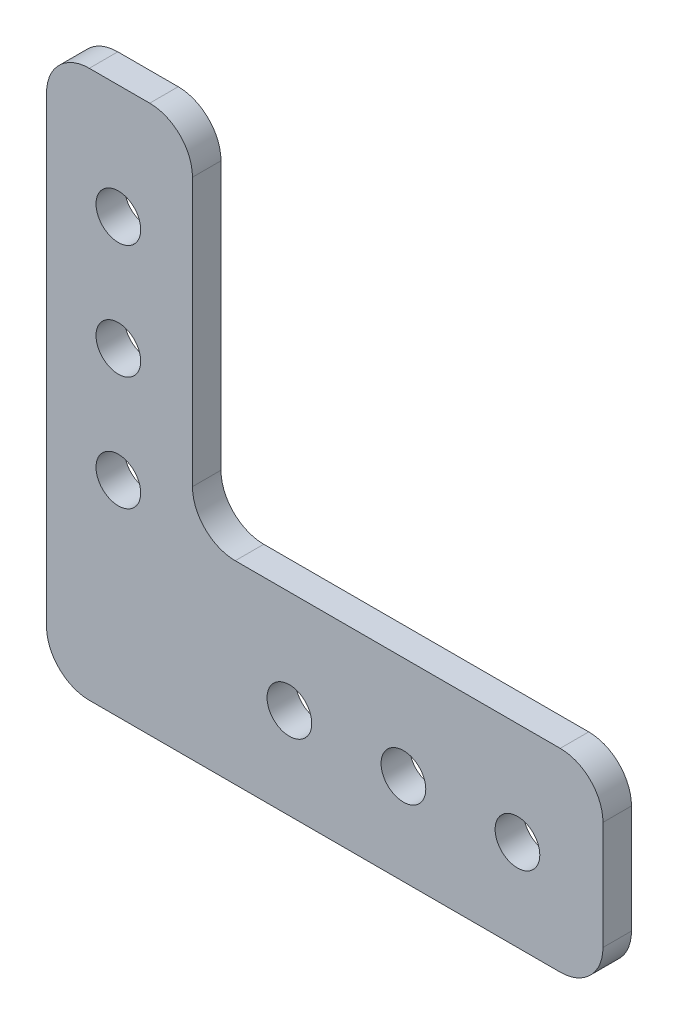
ISO-10303-21;
HEADER;
FILE_DESCRIPTION(('STEP AP214'),'2;1');
FILE_NAME('part.step','',(''),(''),'','','');
FILE_SCHEMA(('AUTOMOTIVE_DESIGN { 1 0 10303 214 1 1 1 1 }'));
ENDSEC;
DATA;
#1=APPLICATION_CONTEXT('core data for automotive mechanical design processes');
#2=APPLICATION_PROTOCOL_DEFINITION('international standard','automotive_design',2000,#1);
#3=PRODUCT_CONTEXT('',#1,'mechanical');
#4=PRODUCT('Part','Part','',(#3));
#5=PRODUCT_RELATED_PRODUCT_CATEGORY('part','',(#4));
#6=PRODUCT_DEFINITION_FORMATION('','',#4);
#7=PRODUCT_DEFINITION_CONTEXT('part definition',#1,'design');
#8=PRODUCT_DEFINITION('design','',#6,#7);
#9=PRODUCT_DEFINITION_SHAPE('','',#8);
#10=(LENGTH_UNIT() NAMED_UNIT(*) SI_UNIT(.MILLI.,.METRE.));
#11=(NAMED_UNIT(*) PLANE_ANGLE_UNIT() SI_UNIT($,.RADIAN.));
#12=(NAMED_UNIT(*) SI_UNIT($,.STERADIAN.) SOLID_ANGLE_UNIT());
#13=UNCERTAINTY_MEASURE_WITH_UNIT(LENGTH_MEASURE(1.E-05),#10,'distance_accuracy_value','');
#14=(GEOMETRIC_REPRESENTATION_CONTEXT(3) GLOBAL_UNCERTAINTY_ASSIGNED_CONTEXT((#13)) GLOBAL_UNIT_ASSIGNED_CONTEXT((#10,
#11,#12)) REPRESENTATION_CONTEXT('',''));
#15=CARTESIAN_POINT('',(0.,0.,0.));
#16=DIRECTION('',(0.,0.,1.));
#17=DIRECTION('',(1.,0.,0.));
#18=AXIS2_PLACEMENT_3D('',#15,#16,#17);
#19=CARTESIAN_POINT('',(-27.051,0.,3.175));
#20=DIRECTION('',(-1.,0.,0.));
#21=DIRECTION('',(0.,0.,1.));
#22=AXIS2_PLACEMENT_3D('',#19,#20,#21);
#23=PLANE('',#22);
#24=DIRECTION('',(0.,1.,0.));
#25=VECTOR('',#24,1.);
#26=CARTESIAN_POINT('',(-27.051,0.,3.175));
#27=LINE('',#26,#25);
#28=CARTESIAN_POINT('',(-27.051,-24.4475,3.175));
#29=VERTEX_POINT('',#28);
#30=CARTESIAN_POINT('',(-27.051,26.9875,3.175));
#31=VERTEX_POINT('',#30);
#32=EDGE_CURVE('E261',#29,#31,#27,.T.);
#33=ORIENTED_EDGE('',*,*,#32,.T.);
#34=DIRECTION('',(0.,0.,-1.));
#35=VECTOR('',#34,1.);
#36=CARTESIAN_POINT('',(-27.051,26.9875,3.175));
#37=LINE('',#36,#35);
#38=CARTESIAN_POINT('',(-27.051,26.9875,0.));
#39=VERTEX_POINT('',#38);
#40=EDGE_CURVE('E136',#31,#39,#37,.T.);
#41=ORIENTED_EDGE('',*,*,#40,.T.);
#42=DIRECTION('',(0.,1.,0.));
#43=VECTOR('',#42,1.);
#44=CARTESIAN_POINT('',(-27.051,0.,0.));
#45=LINE('',#44,#43);
#46=CARTESIAN_POINT('',(-27.051,-24.4475,0.));
#47=VERTEX_POINT('',#46);
#48=EDGE_CURVE('E128',#47,#39,#45,.T.);
#49=ORIENTED_EDGE('',*,*,#48,.F.);
#50=DIRECTION('',(0.,0.,-1.));
#51=VECTOR('',#50,1.);
#52=CARTESIAN_POINT('',(-27.051,-24.4475,3.175));
#53=LINE('',#52,#51);
#54=EDGE_CURVE('E141',#47,#29,#53,.F.);
#55=ORIENTED_EDGE('',*,*,#54,.T.);
#56=EDGE_LOOP('',(#33,#41,#49,#55));
#57=FACE_BOUND('',#56,.T.);
#58=ADVANCED_FACE('F36',(#57),#23,.T.);
#59=CARTESIAN_POINT('',(0.,-29.21,3.175));
#60=DIRECTION('',(0.,1.,0.));
#61=DIRECTION('',(0.,0.,1.));
#62=AXIS2_PLACEMENT_3D('',#59,#60,#61);
#63=PLANE('',#62);
#64=DIRECTION('',(1.,0.,0.));
#65=VECTOR('',#64,1.);
#66=CARTESIAN_POINT('',(0.,-29.21,0.));
#67=LINE('',#66,#65);
#68=CARTESIAN_POINT('',(-22.2885,-29.21,0.));
#69=VERTEX_POINT('',#68);
#70=CARTESIAN_POINT('',(30.1625,-29.21,0.));
#71=VERTEX_POINT('',#70);
#72=EDGE_CURVE('E130',#69,#71,#67,.T.);
#73=ORIENTED_EDGE('',*,*,#72,.T.);
#74=DIRECTION('',(0.,0.,-1.));
#75=VECTOR('',#74,1.);
#76=CARTESIAN_POINT('',(30.1625,-29.21,3.175));
#77=LINE('',#76,#75);
#78=CARTESIAN_POINT('',(30.1625,-29.21,3.175));
#79=VERTEX_POINT('',#78);
#80=EDGE_CURVE('E195',#71,#79,#77,.F.);
#81=ORIENTED_EDGE('',*,*,#80,.T.);
#82=DIRECTION('',(1.,0.,0.));
#83=VECTOR('',#82,1.);
#84=CARTESIAN_POINT('',(0.,-29.21,3.175));
#85=LINE('',#84,#83);
#86=CARTESIAN_POINT('',(-22.2885,-29.21,3.175));
#87=VERTEX_POINT('',#86);
#88=EDGE_CURVE('E263',#87,#79,#85,.T.);
#89=ORIENTED_EDGE('',*,*,#88,.F.);
#90=DIRECTION('',(0.,0.,-1.));
#91=VECTOR('',#90,1.);
#92=CARTESIAN_POINT('',(-22.2885,-29.21,0.));
#93=LINE('',#92,#91);
#94=EDGE_CURVE('E193',#87,#69,#93,.T.);
#95=ORIENTED_EDGE('',*,*,#94,.T.);
#96=EDGE_LOOP('',(#73,#81,#89,#95));
#97=FACE_BOUND('',#96,.T.);
#98=ADVANCED_FACE('F282',(#97),#63,.F.);
#99=CARTESIAN_POINT('',(34.925,0.,3.175));
#100=DIRECTION('',(-1.,0.,0.));
#101=DIRECTION('',(0.,0.,1.));
#102=AXIS2_PLACEMENT_3D('',#99,#100,#101);
#103=PLANE('',#102);
#104=DIRECTION('',(0.,1.,0.));
#105=VECTOR('',#104,1.);
#106=CARTESIAN_POINT('',(34.925,0.,0.));
#107=LINE('',#106,#105);
#108=CARTESIAN_POINT('',(34.925,-24.4475,0.));
#109=VERTEX_POINT('',#108);
#110=CARTESIAN_POINT('',(34.925,-12.3825,0.));
#111=VERTEX_POINT('',#110);
#112=EDGE_CURVE('E208',#109,#111,#107,.T.);
#113=ORIENTED_EDGE('',*,*,#112,.T.);
#114=DIRECTION('',(0.,0.,-1.));
#115=VECTOR('',#114,1.);
#116=CARTESIAN_POINT('',(34.925,-12.3825,3.175));
#117=LINE('',#116,#115);
#118=CARTESIAN_POINT('',(34.925,-12.3825,3.175));
#119=VERTEX_POINT('',#118);
#120=EDGE_CURVE('E191',#111,#119,#117,.F.);
#121=ORIENTED_EDGE('',*,*,#120,.T.);
#122=DIRECTION('',(0.,1.,0.));
#123=VECTOR('',#122,1.);
#124=CARTESIAN_POINT('',(34.925,0.,3.175));
#125=LINE('',#124,#123);
#126=CARTESIAN_POINT('',(34.925,-24.4475,3.175));
#127=VERTEX_POINT('',#126);
#128=EDGE_CURVE('E215',#127,#119,#125,.T.);
#129=ORIENTED_EDGE('',*,*,#128,.F.);
#130=DIRECTION('',(0.,0.,-1.));
#131=VECTOR('',#130,1.);
#132=CARTESIAN_POINT('',(34.925,-24.4475,3.175));
#133=LINE('',#132,#131);
#134=EDGE_CURVE('E188',#127,#109,#133,.T.);
#135=ORIENTED_EDGE('',*,*,#134,.T.);
#136=EDGE_LOOP('',(#113,#121,#129,#135));
#137=FACE_BOUND('',#136,.T.);
#138=ADVANCED_FACE('F277',(#137),#103,.F.);
#139=CARTESIAN_POINT('',(0.,-7.62000000000001,3.175));
#140=DIRECTION('',(0.,-1.,0.));
#141=DIRECTION('',(1.,0.,0.));
#142=AXIS2_PLACEMENT_3D('',#139,#140,#141);
#143=PLANE('',#142);
#144=DIRECTION('',(-1.,0.,0.));
#145=VECTOR('',#144,1.);
#146=CARTESIAN_POINT('',(0.,-7.62000000000001,0.));
#147=LINE('',#146,#145);
#148=CARTESIAN_POINT('',(30.1625,-7.62000000000001,0.));
#149=VERTEX_POINT('',#148);
#150=CARTESIAN_POINT('',(-6.0325,-7.62000000000002,0.));
#151=VERTEX_POINT('',#150);
#152=EDGE_CURVE('E199',#149,#151,#147,.T.);
#153=ORIENTED_EDGE('',*,*,#152,.T.);
#154=DIRECTION('',(0.,0.,-1.));
#155=VECTOR('',#154,1.);
#156=CARTESIAN_POINT('',(-6.0325,-7.62000000000002,3.175));
#157=LINE('',#156,#155);
#158=CARTESIAN_POINT('',(-6.0325,-7.62000000000002,3.175));
#159=VERTEX_POINT('',#158);
#160=EDGE_CURVE('E186',#151,#159,#157,.F.);
#161=ORIENTED_EDGE('',*,*,#160,.T.);
#162=DIRECTION('',(-1.,0.,0.));
#163=VECTOR('',#162,1.);
#164=CARTESIAN_POINT('',(0.,-7.62000000000001,3.175));
#165=LINE('',#164,#163);
#166=CARTESIAN_POINT('',(30.1625,-7.62000000000001,3.175));
#167=VERTEX_POINT('',#166);
#168=EDGE_CURVE('E213',#167,#159,#165,.T.);
#169=ORIENTED_EDGE('',*,*,#168,.F.);
#170=DIRECTION('',(0.,0.,-1.));
#171=VECTOR('',#170,1.);
#172=CARTESIAN_POINT('',(30.1625,-7.62000000000001,3.175));
#173=LINE('',#172,#171);
#174=EDGE_CURVE('E183',#167,#149,#173,.T.);
#175=ORIENTED_EDGE('',*,*,#174,.T.);
#176=EDGE_LOOP('',(#153,#161,#169,#175));
#177=FACE_BOUND('',#176,.T.);
#178=ADVANCED_FACE('F205',(#177),#143,.F.);
#179=CARTESIAN_POINT('',(-10.795,0.,3.175));
#180=DIRECTION('',(1.,0.,0.));
#181=DIRECTION('',(0.,1.,0.));
#182=AXIS2_PLACEMENT_3D('',#179,#180,#181);
#183=PLANE('',#182);
#184=DIRECTION('',(0.,-1.,0.));
#185=VECTOR('',#184,1.);
#186=CARTESIAN_POINT('',(-10.795,0.,0.));
#187=LINE('',#186,#185);
#188=CARTESIAN_POINT('',(-10.795,26.9875,0.));
#189=VERTEX_POINT('',#188);
#190=CARTESIAN_POINT('',(-10.795,-2.85750000000002,0.));
#191=VERTEX_POINT('',#190);
#192=EDGE_CURVE('E200',#189,#191,#187,.T.);
#193=ORIENTED_EDGE('',*,*,#192,.F.);
#194=DIRECTION('',(0.,0.,-1.));
#195=VECTOR('',#194,1.);
#196=CARTESIAN_POINT('',(-10.795,26.9875,3.175));
#197=LINE('',#196,#195);
#198=CARTESIAN_POINT('',(-10.795,26.9875,3.175));
#199=VERTEX_POINT('',#198);
#200=EDGE_CURVE('E56',#189,#199,#197,.F.);
#201=ORIENTED_EDGE('',*,*,#200,.T.);
#202=DIRECTION('',(0.,-1.,0.));
#203=VECTOR('',#202,1.);
#204=CARTESIAN_POINT('',(-10.795,0.,3.175));
#205=LINE('',#204,#203);
#206=CARTESIAN_POINT('',(-10.795,-2.85750000000002,3.175));
#207=VERTEX_POINT('',#206);
#208=EDGE_CURVE('E152',#199,#207,#205,.T.);
#209=ORIENTED_EDGE('',*,*,#208,.T.);
#210=DIRECTION('',(0.,0.,-1.));
#211=VECTOR('',#210,1.);
#212=CARTESIAN_POINT('',(-10.795,-2.85750000000002,3.175));
#213=LINE('',#212,#211);
#214=EDGE_CURVE('E179',#207,#191,#213,.T.);
#215=ORIENTED_EDGE('',*,*,#214,.T.);
#216=EDGE_LOOP('',(#193,#201,#209,#215));
#217=FACE_BOUND('',#216,.T.);
#218=ADVANCED_FACE('F211',(#217),#183,.T.);
#219=CARTESIAN_POINT('',(-19.05,-6.35000000000001,3.175));
#220=DIRECTION('',(0.,0.,-1.));
#221=DIRECTION('',(-1.,0.,0.));
#222=AXIS2_PLACEMENT_3D('',#219,#220,#221);
#223=CYLINDRICAL_SURFACE('',#222,2.4892);
#224=CARTESIAN_POINT('',(-19.05,-6.35000000000001,3.175));
#225=DIRECTION('',(0.,0.,1.));
#226=DIRECTION('',(1.,0.,0.));
#227=AXIS2_PLACEMENT_3D('',#224,#225,#226);
#228=CIRCLE('',#227,2.4892);
#229=CARTESIAN_POINT('',(-16.5608,-6.35000000000001,3.175));
#230=VERTEX_POINT('',#229);
#231=EDGE_CURVE('E258',#230,#230,#228,.T.);
#232=ORIENTED_EDGE('',*,*,#231,.T.);
#233=EDGE_LOOP('',(#232));
#234=FACE_BOUND('',#233,.T.);
#235=CARTESIAN_POINT('',(-19.05,-6.35000000000001,0.));
#236=DIRECTION('',(0.,0.,1.));
#237=DIRECTION('',(1.,0.,0.));
#238=AXIS2_PLACEMENT_3D('',#235,#236,#237);
#239=CIRCLE('',#238,2.4892);
#240=CARTESIAN_POINT('',(-16.5608,-6.35000000000001,0.));
#241=VERTEX_POINT('',#240);
#242=EDGE_CURVE('E144',#241,#241,#239,.T.);
#243=ORIENTED_EDGE('',*,*,#242,.F.);
#244=EDGE_LOOP('',(#243));
#245=FACE_BOUND('',#244,.T.);
#246=ADVANCED_FACE('F309',(#234,#245),#223,.F.);
#247=CARTESIAN_POINT('',(-19.05,6.34999999999999,3.175));
#248=DIRECTION('',(0.,0.,-1.));
#249=DIRECTION('',(-1.,0.,0.));
#250=AXIS2_PLACEMENT_3D('',#247,#248,#249);
#251=CYLINDRICAL_SURFACE('',#250,2.4892);
#252=CARTESIAN_POINT('',(-19.05,6.34999999999999,3.175));
#253=DIRECTION('',(0.,0.,1.));
#254=DIRECTION('',(1.,0.,0.));
#255=AXIS2_PLACEMENT_3D('',#252,#253,#254);
#256=CIRCLE('',#255,2.4892);
#257=CARTESIAN_POINT('',(-16.5608,6.34999999999999,3.175));
#258=VERTEX_POINT('',#257);
#259=EDGE_CURVE('E255',#258,#258,#256,.T.);
#260=ORIENTED_EDGE('',*,*,#259,.T.);
#261=EDGE_LOOP('',(#260));
#262=FACE_BOUND('',#261,.T.);
#263=CARTESIAN_POINT('',(-19.05,6.34999999999999,0.));
#264=DIRECTION('',(0.,0.,1.));
#265=DIRECTION('',(1.,0.,0.));
#266=AXIS2_PLACEMENT_3D('',#263,#264,#265);
#267=CIRCLE('',#266,2.4892);
#268=CARTESIAN_POINT('',(-16.5608,6.34999999999999,0.));
#269=VERTEX_POINT('',#268);
#270=EDGE_CURVE('E231',#269,#269,#267,.T.);
#271=ORIENTED_EDGE('',*,*,#270,.F.);
#272=EDGE_LOOP('',(#271));
#273=FACE_BOUND('',#272,.T.);
#274=ADVANCED_FACE('F312',(#262,#273),#251,.F.);
#275=CARTESIAN_POINT('',(-19.05,19.05,3.175));
#276=DIRECTION('',(0.,0.,-1.));
#277=DIRECTION('',(-1.,0.,0.));
#278=AXIS2_PLACEMENT_3D('',#275,#276,#277);
#279=CYLINDRICAL_SURFACE('',#278,2.4892);
#280=CARTESIAN_POINT('',(-19.05,19.05,3.175));
#281=DIRECTION('',(0.,0.,1.));
#282=DIRECTION('',(1.,0.,0.));
#283=AXIS2_PLACEMENT_3D('',#280,#281,#282);
#284=CIRCLE('',#283,2.4892);
#285=CARTESIAN_POINT('',(-16.5608,19.05,3.175));
#286=VERTEX_POINT('',#285);
#287=EDGE_CURVE('E252',#286,#286,#284,.T.);
#288=ORIENTED_EDGE('',*,*,#287,.T.);
#289=EDGE_LOOP('',(#288));
#290=FACE_BOUND('',#289,.T.);
#291=CARTESIAN_POINT('',(-19.05,19.05,0.));
#292=DIRECTION('',(0.,0.,1.));
#293=DIRECTION('',(1.,0.,0.));
#294=AXIS2_PLACEMENT_3D('',#291,#292,#293);
#295=CIRCLE('',#294,2.4892);
#296=CARTESIAN_POINT('',(-16.5608,19.05,0.));
#297=VERTEX_POINT('',#296);
#298=EDGE_CURVE('E228',#297,#297,#295,.T.);
#299=ORIENTED_EDGE('',*,*,#298,.F.);
#300=EDGE_LOOP('',(#299));
#301=FACE_BOUND('',#300,.T.);
#302=ADVANCED_FACE('F316',(#290,#301),#279,.F.);
#303=CARTESIAN_POINT('',(0.,-19.05,3.175));
#304=DIRECTION('',(0.,0.,-1.));
#305=DIRECTION('',(-1.,0.,0.));
#306=AXIS2_PLACEMENT_3D('',#303,#304,#305);
#307=CYLINDRICAL_SURFACE('',#306,2.4892);
#308=CARTESIAN_POINT('',(0.,-19.05,3.175));
#309=DIRECTION('',(0.,0.,1.));
#310=DIRECTION('',(1.,0.,0.));
#311=AXIS2_PLACEMENT_3D('',#308,#309,#310);
#312=CIRCLE('',#311,2.4892);
#313=CARTESIAN_POINT('',(2.48919999999999,-19.05,3.175));
#314=VERTEX_POINT('',#313);
#315=EDGE_CURVE('E247',#314,#314,#312,.T.);
#316=ORIENTED_EDGE('',*,*,#315,.T.);
#317=EDGE_LOOP('',(#316));
#318=FACE_BOUND('',#317,.T.);
#319=CARTESIAN_POINT('',(0.,-19.05,0.));
#320=DIRECTION('',(0.,0.,1.));
#321=DIRECTION('',(1.,0.,0.));
#322=AXIS2_PLACEMENT_3D('',#319,#320,#321);
#323=CIRCLE('',#322,2.4892);
#324=CARTESIAN_POINT('',(2.48919999999999,-19.05,0.));
#325=VERTEX_POINT('',#324);
#326=EDGE_CURVE('E225',#325,#325,#323,.T.);
#327=ORIENTED_EDGE('',*,*,#326,.F.);
#328=EDGE_LOOP('',(#327));
#329=FACE_BOUND('',#328,.T.);
#330=ADVANCED_FACE('F320',(#318,#329),#307,.F.);
#331=CARTESIAN_POINT('',(12.7,-19.05,3.175));
#332=DIRECTION('',(0.,0.,-1.));
#333=DIRECTION('',(-1.,0.,0.));
#334=AXIS2_PLACEMENT_3D('',#331,#332,#333);
#335=CYLINDRICAL_SURFACE('',#334,2.4892);
#336=CARTESIAN_POINT('',(12.7,-19.05,3.175));
#337=DIRECTION('',(0.,0.,1.));
#338=DIRECTION('',(1.,0.,0.));
#339=AXIS2_PLACEMENT_3D('',#336,#337,#338);
#340=CIRCLE('',#339,2.4892);
#341=CARTESIAN_POINT('',(15.1892,-19.05,3.175));
#342=VERTEX_POINT('',#341);
#343=EDGE_CURVE('E242',#342,#342,#340,.T.);
#344=ORIENTED_EDGE('',*,*,#343,.T.);
#345=EDGE_LOOP('',(#344));
#346=FACE_BOUND('',#345,.T.);
#347=CARTESIAN_POINT('',(12.7,-19.05,0.));
#348=DIRECTION('',(0.,0.,1.));
#349=DIRECTION('',(1.,0.,0.));
#350=AXIS2_PLACEMENT_3D('',#347,#348,#349);
#351=CIRCLE('',#350,2.4892);
#352=CARTESIAN_POINT('',(15.1892,-19.05,0.));
#353=VERTEX_POINT('',#352);
#354=EDGE_CURVE('E222',#353,#353,#351,.T.);
#355=ORIENTED_EDGE('',*,*,#354,.F.);
#356=EDGE_LOOP('',(#355));
#357=FACE_BOUND('',#356,.T.);
#358=ADVANCED_FACE('F324',(#346,#357),#335,.F.);
#359=CARTESIAN_POINT('',(25.4,-19.05,3.175));
#360=DIRECTION('',(0.,0.,-1.));
#361=DIRECTION('',(-1.,0.,0.));
#362=AXIS2_PLACEMENT_3D('',#359,#360,#361);
#363=CYLINDRICAL_SURFACE('',#362,2.4892);
#364=CARTESIAN_POINT('',(25.4,-19.05,3.175));
#365=DIRECTION('',(0.,0.,1.));
#366=DIRECTION('',(1.,0.,0.));
#367=AXIS2_PLACEMENT_3D('',#364,#365,#366);
#368=CIRCLE('',#367,2.4892);
#369=CARTESIAN_POINT('',(27.8892,-19.05,3.175));
#370=VERTEX_POINT('',#369);
#371=EDGE_CURVE('E239',#370,#370,#368,.T.);
#372=ORIENTED_EDGE('',*,*,#371,.T.);
#373=EDGE_LOOP('',(#372));
#374=FACE_BOUND('',#373,.T.);
#375=CARTESIAN_POINT('',(25.4,-19.05,0.));
#376=DIRECTION('',(0.,0.,1.));
#377=DIRECTION('',(1.,0.,0.));
#378=AXIS2_PLACEMENT_3D('',#375,#376,#377);
#379=CIRCLE('',#378,2.4892);
#380=CARTESIAN_POINT('',(27.8892,-19.05,0.));
#381=VERTEX_POINT('',#380);
#382=EDGE_CURVE('E219',#381,#381,#379,.T.);
#383=ORIENTED_EDGE('',*,*,#382,.F.);
#384=EDGE_LOOP('',(#383));
#385=FACE_BOUND('',#384,.T.);
#386=ADVANCED_FACE('F328',(#374,#385),#363,.F.);
#387=CARTESIAN_POINT('',(0.,31.75,3.175));
#388=DIRECTION('',(0.,1.,0.));
#389=DIRECTION('',(-1.,0.,0.));
#390=AXIS2_PLACEMENT_3D('',#387,#388,#389);
#391=PLANE('',#390);
#392=DIRECTION('',(1.,0.,0.));
#393=VECTOR('',#392,1.);
#394=CARTESIAN_POINT('',(0.,31.75,0.));
#395=LINE('',#394,#393);
#396=CARTESIAN_POINT('',(-22.2885,31.75,0.));
#397=VERTEX_POINT('',#396);
#398=CARTESIAN_POINT('',(-15.5575,31.75,0.));
#399=VERTEX_POINT('',#398);
#400=EDGE_CURVE('E155',#397,#399,#395,.T.);
#401=ORIENTED_EDGE('',*,*,#400,.F.);
#402=DIRECTION('',(0.,0.,-1.));
#403=VECTOR('',#402,1.);
#404=CARTESIAN_POINT('',(-22.2885,31.75,3.175));
#405=LINE('',#404,#403);
#406=CARTESIAN_POINT('',(-22.2885,31.75,3.175));
#407=VERTEX_POINT('',#406);
#408=EDGE_CURVE('E168',#397,#407,#405,.F.);
#409=ORIENTED_EDGE('',*,*,#408,.T.);
#410=DIRECTION('',(1.,0.,0.));
#411=VECTOR('',#410,1.);
#412=CARTESIAN_POINT('',(0.,31.75,3.175));
#413=LINE('',#412,#411);
#414=CARTESIAN_POINT('',(-15.5575,31.75,3.175));
#415=VERTEX_POINT('',#414);
#416=EDGE_CURVE('E148',#407,#415,#413,.T.);
#417=ORIENTED_EDGE('',*,*,#416,.T.);
#418=DIRECTION('',(0.,0.,-1.));
#419=VECTOR('',#418,1.);
#420=CARTESIAN_POINT('',(-15.5575,31.75,3.175));
#421=LINE('',#420,#419);
#422=EDGE_CURVE('E165',#415,#399,#421,.T.);
#423=ORIENTED_EDGE('',*,*,#422,.T.);
#424=EDGE_LOOP('',(#401,#409,#417,#423));
#425=FACE_BOUND('',#424,.T.);
#426=ADVANCED_FACE('F289',(#425),#391,.T.);
#427=CARTESIAN_POINT('',(0.,0.,3.175));
#428=DIRECTION('',(0.,0.,1.));
#429=DIRECTION('',(1.,0.,0.));
#430=AXIS2_PLACEMENT_3D('',#427,#428,#429);
#431=PLANE('',#430);
#432=ORIENTED_EDGE('',*,*,#371,.F.);
#433=EDGE_LOOP('',(#432));
#434=FACE_BOUND('',#433,.T.);
#435=ORIENTED_EDGE('',*,*,#343,.F.);
#436=EDGE_LOOP('',(#435));
#437=FACE_BOUND('',#436,.T.);
#438=ORIENTED_EDGE('',*,*,#315,.F.);
#439=EDGE_LOOP('',(#438));
#440=FACE_BOUND('',#439,.T.);
#441=ORIENTED_EDGE('',*,*,#287,.F.);
#442=EDGE_LOOP('',(#441));
#443=FACE_BOUND('',#442,.T.);
#444=ORIENTED_EDGE('',*,*,#259,.F.);
#445=EDGE_LOOP('',(#444));
#446=FACE_BOUND('',#445,.T.);
#447=ORIENTED_EDGE('',*,*,#231,.F.);
#448=EDGE_LOOP('',(#447));
#449=FACE_BOUND('',#448,.T.);
#450=ORIENTED_EDGE('',*,*,#416,.F.);
#451=CARTESIAN_POINT('',(-22.2885,26.9875,3.175));
#452=DIRECTION('',(0.,0.,1.));
#453=DIRECTION('',(1.,0.,0.));
#454=AXIS2_PLACEMENT_3D('',#451,#452,#453);
#455=CIRCLE('',#454,4.7625);
#456=EDGE_CURVE('E177',#407,#31,#455,.T.);
#457=ORIENTED_EDGE('',*,*,#456,.T.);
#458=ORIENTED_EDGE('',*,*,#32,.F.);
#459=CARTESIAN_POINT('',(-22.2885,-24.4475,3.175));
#460=DIRECTION('',(0.,0.,1.));
#461=DIRECTION('',(1.,0.,0.));
#462=AXIS2_PLACEMENT_3D('',#459,#460,#461);
#463=CIRCLE('',#462,4.7625);
#464=EDGE_CURVE('E147',#29,#87,#463,.T.);
#465=ORIENTED_EDGE('',*,*,#464,.T.);
#466=ORIENTED_EDGE('',*,*,#88,.T.);
#467=CARTESIAN_POINT('',(30.1625,-24.4475,3.175));
#468=DIRECTION('',(0.,0.,1.));
#469=DIRECTION('',(1.,0.,0.));
#470=AXIS2_PLACEMENT_3D('',#467,#468,#469);
#471=CIRCLE('',#470,4.7625);
#472=EDGE_CURVE('E171',#79,#127,#471,.T.);
#473=ORIENTED_EDGE('',*,*,#472,.T.);
#474=ORIENTED_EDGE('',*,*,#128,.T.);
#475=CARTESIAN_POINT('',(30.1625,-12.3825,3.175));
#476=DIRECTION('',(0.,0.,1.));
#477=DIRECTION('',(1.,0.,0.));
#478=AXIS2_PLACEMENT_3D('',#475,#476,#477);
#479=CIRCLE('',#478,4.7625);
#480=EDGE_CURVE('E173',#119,#167,#479,.T.);
#481=ORIENTED_EDGE('',*,*,#480,.T.);
#482=ORIENTED_EDGE('',*,*,#168,.T.);
#483=CARTESIAN_POINT('',(-6.0325,-2.85750000000001,3.175));
#484=DIRECTION('',(0.,0.,1.));
#485=DIRECTION('',(1.,0.,0.));
#486=AXIS2_PLACEMENT_3D('',#483,#484,#485);
#487=CIRCLE('',#486,4.7625);
#488=EDGE_CURVE('E11',#159,#207,#487,.F.);
#489=ORIENTED_EDGE('',*,*,#488,.T.);
#490=ORIENTED_EDGE('',*,*,#208,.F.);
#491=CARTESIAN_POINT('',(-15.5575,26.9875,3.175));
#492=DIRECTION('',(0.,0.,1.));
#493=DIRECTION('',(1.,0.,0.));
#494=AXIS2_PLACEMENT_3D('',#491,#492,#493);
#495=CIRCLE('',#494,4.7625);
#496=EDGE_CURVE('E175',#199,#415,#495,.T.);
#497=ORIENTED_EDGE('',*,*,#496,.T.);
#498=EDGE_LOOP('',(#450,#457,#458,#465,#466,#473,#474,#481,#482,#489,#490,#497));
#499=FACE_BOUND('',#498,.T.);
#500=ADVANCED_FACE('F269',(#434,#437,#440,#443,#446,#449,#499),#431,.T.);
#501=CARTESIAN_POINT('',(0.,0.,0.));
#502=DIRECTION('',(0.,0.,1.));
#503=DIRECTION('',(1.,0.,0.));
#504=AXIS2_PLACEMENT_3D('',#501,#502,#503);
#505=PLANE('',#504);
#506=ORIENTED_EDGE('',*,*,#382,.T.);
#507=EDGE_LOOP('',(#506));
#508=FACE_BOUND('',#507,.T.);
#509=ORIENTED_EDGE('',*,*,#354,.T.);
#510=EDGE_LOOP('',(#509));
#511=FACE_BOUND('',#510,.T.);
#512=ORIENTED_EDGE('',*,*,#326,.T.);
#513=EDGE_LOOP('',(#512));
#514=FACE_BOUND('',#513,.T.);
#515=ORIENTED_EDGE('',*,*,#298,.T.);
#516=EDGE_LOOP('',(#515));
#517=FACE_BOUND('',#516,.T.);
#518=ORIENTED_EDGE('',*,*,#270,.T.);
#519=EDGE_LOOP('',(#518));
#520=FACE_BOUND('',#519,.T.);
#521=ORIENTED_EDGE('',*,*,#242,.T.);
#522=EDGE_LOOP('',(#521));
#523=FACE_BOUND('',#522,.T.);
#524=ORIENTED_EDGE('',*,*,#48,.T.);
#525=CARTESIAN_POINT('',(-22.2885,26.9875,0.));
#526=DIRECTION('',(0.,0.,1.));
#527=DIRECTION('',(1.,0.,0.));
#528=AXIS2_PLACEMENT_3D('',#525,#526,#527);
#529=CIRCLE('',#528,4.7625);
#530=EDGE_CURVE('E163',#39,#397,#529,.F.);
#531=ORIENTED_EDGE('',*,*,#530,.T.);
#532=ORIENTED_EDGE('',*,*,#400,.T.);
#533=CARTESIAN_POINT('',(-15.5575,26.9875,0.));
#534=DIRECTION('',(0.,0.,1.));
#535=DIRECTION('',(1.,0.,0.));
#536=AXIS2_PLACEMENT_3D('',#533,#534,#535);
#537=CIRCLE('',#536,4.7625);
#538=EDGE_CURVE('E161',#399,#189,#537,.F.);
#539=ORIENTED_EDGE('',*,*,#538,.T.);
#540=ORIENTED_EDGE('',*,*,#192,.T.);
#541=CARTESIAN_POINT('',(-6.0325,-2.85750000000001,0.));
#542=DIRECTION('',(0.,0.,1.));
#543=DIRECTION('',(1.,0.,0.));
#544=AXIS2_PLACEMENT_3D('',#541,#542,#543);
#545=CIRCLE('',#544,4.7625);
#546=EDGE_CURVE('E44',#191,#151,#545,.T.);
#547=ORIENTED_EDGE('',*,*,#546,.T.);
#548=ORIENTED_EDGE('',*,*,#152,.F.);
#549=CARTESIAN_POINT('',(30.1625,-12.3825,0.));
#550=DIRECTION('',(0.,0.,1.));
#551=DIRECTION('',(1.,0.,0.));
#552=AXIS2_PLACEMENT_3D('',#549,#550,#551);
#553=CIRCLE('',#552,4.7625);
#554=EDGE_CURVE('E159',#149,#111,#553,.F.);
#555=ORIENTED_EDGE('',*,*,#554,.T.);
#556=ORIENTED_EDGE('',*,*,#112,.F.);
#557=CARTESIAN_POINT('',(30.1625,-24.4475,0.));
#558=DIRECTION('',(0.,0.,1.));
#559=DIRECTION('',(1.,0.,0.));
#560=AXIS2_PLACEMENT_3D('',#557,#558,#559);
#561=CIRCLE('',#560,4.7625);
#562=EDGE_CURVE('E135',#109,#71,#561,.F.);
#563=ORIENTED_EDGE('',*,*,#562,.T.);
#564=ORIENTED_EDGE('',*,*,#72,.F.);
#565=CARTESIAN_POINT('',(-22.2885,-24.4475,0.));
#566=DIRECTION('',(0.,0.,1.));
#567=DIRECTION('',(1.,0.,0.));
#568=AXIS2_PLACEMENT_3D('',#565,#566,#567);
#569=CIRCLE('',#568,4.7625);
#570=EDGE_CURVE('E125',#69,#47,#569,.F.);
#571=ORIENTED_EDGE('',*,*,#570,.T.);
#572=EDGE_LOOP('',(#524,#531,#532,#539,#540,#547,#548,#555,#556,#563,#564,#571));
#573=FACE_BOUND('',#572,.T.);
#574=ADVANCED_FACE('F127',(#508,#511,#514,#517,#520,#523,#573),#505,.F.);
#575=CARTESIAN_POINT('',(-22.2885,26.9875,3.175));
#576=DIRECTION('',(0.,0.,-1.));
#577=DIRECTION('',(-1.,0.,0.));
#578=AXIS2_PLACEMENT_3D('',#575,#576,#577);
#579=CYLINDRICAL_SURFACE('',#578,4.7625);
#580=ORIENTED_EDGE('',*,*,#456,.F.);
#581=ORIENTED_EDGE('',*,*,#408,.F.);
#582=ORIENTED_EDGE('',*,*,#530,.F.);
#583=ORIENTED_EDGE('',*,*,#40,.F.);
#584=EDGE_LOOP('',(#580,#581,#582,#583));
#585=FACE_BOUND('',#584,.T.);
#586=ADVANCED_FACE('F286',(#585),#579,.T.);
#587=CARTESIAN_POINT('',(-15.5575,26.9875,3.175));
#588=DIRECTION('',(0.,0.,-1.));
#589=DIRECTION('',(-1.,0.,0.));
#590=AXIS2_PLACEMENT_3D('',#587,#588,#589);
#591=CYLINDRICAL_SURFACE('',#590,4.7625);
#592=ORIENTED_EDGE('',*,*,#496,.F.);
#593=ORIENTED_EDGE('',*,*,#200,.F.);
#594=ORIENTED_EDGE('',*,*,#538,.F.);
#595=ORIENTED_EDGE('',*,*,#422,.F.);
#596=EDGE_LOOP('',(#592,#593,#594,#595));
#597=FACE_BOUND('',#596,.T.);
#598=ADVANCED_FACE('F292',(#597),#591,.T.);
#599=CARTESIAN_POINT('',(-6.0325,-2.85750000000001,3.175));
#600=DIRECTION('',(0.,0.,-1.));
#601=DIRECTION('',(-1.,0.,0.));
#602=AXIS2_PLACEMENT_3D('',#599,#600,#601);
#603=CYLINDRICAL_SURFACE('',#602,4.7625);
#604=ORIENTED_EDGE('',*,*,#488,.F.);
#605=ORIENTED_EDGE('',*,*,#160,.F.);
#606=ORIENTED_EDGE('',*,*,#546,.F.);
#607=ORIENTED_EDGE('',*,*,#214,.F.);
#608=EDGE_LOOP('',(#604,#605,#606,#607));
#609=FACE_BOUND('',#608,.T.);
#610=ADVANCED_FACE('F210',(#609),#603,.F.);
#611=CARTESIAN_POINT('',(30.1625,-12.3825,3.175));
#612=DIRECTION('',(0.,0.,-1.));
#613=DIRECTION('',(-1.,0.,0.));
#614=AXIS2_PLACEMENT_3D('',#611,#612,#613);
#615=CYLINDRICAL_SURFACE('',#614,4.7625);
#616=ORIENTED_EDGE('',*,*,#480,.F.);
#617=ORIENTED_EDGE('',*,*,#120,.F.);
#618=ORIENTED_EDGE('',*,*,#554,.F.);
#619=ORIENTED_EDGE('',*,*,#174,.F.);
#620=EDGE_LOOP('',(#616,#617,#618,#619));
#621=FACE_BOUND('',#620,.T.);
#622=ADVANCED_FACE('F275',(#621),#615,.T.);
#623=CARTESIAN_POINT('',(30.1625,-24.4475,3.175));
#624=DIRECTION('',(0.,0.,-1.));
#625=DIRECTION('',(-1.,0.,0.));
#626=AXIS2_PLACEMENT_3D('',#623,#624,#625);
#627=CYLINDRICAL_SURFACE('',#626,4.7625);
#628=ORIENTED_EDGE('',*,*,#472,.F.);
#629=ORIENTED_EDGE('',*,*,#80,.F.);
#630=ORIENTED_EDGE('',*,*,#562,.F.);
#631=ORIENTED_EDGE('',*,*,#134,.F.);
#632=EDGE_LOOP('',(#628,#629,#630,#631));
#633=FACE_BOUND('',#632,.T.);
#634=ADVANCED_FACE('F279',(#633),#627,.T.);
#635=CARTESIAN_POINT('',(-22.2885,-24.4475,3.175));
#636=DIRECTION('',(0.,0.,1.));
#637=DIRECTION('',(1.,0.,0.));
#638=AXIS2_PLACEMENT_3D('',#635,#636,#637);
#639=CYLINDRICAL_SURFACE('',#638,4.7625);
#640=ORIENTED_EDGE('',*,*,#464,.F.);
#641=ORIENTED_EDGE('',*,*,#54,.F.);
#642=ORIENTED_EDGE('',*,*,#570,.F.);
#643=ORIENTED_EDGE('',*,*,#94,.F.);
#644=EDGE_LOOP('',(#640,#641,#642,#643));
#645=FACE_BOUND('',#644,.T.);
#646=ADVANCED_FACE('F38',(#645),#639,.T.);
#647=CLOSED_SHELL('',(#58,#98,#138,#178,#218,#246,#274,#302,#330,#358,#386,#426,#500,#574,#586,
#598,#610,#622,#634,#646));
#648=MANIFOLD_SOLID_BREP('B2',#647);
#649=ADVANCED_BREP_SHAPE_REPRESENTATION('',(#18,#648),#14);
#650=SHAPE_DEFINITION_REPRESENTATION(#9,#649);
ENDSEC;
END-ISO-10303-21;
